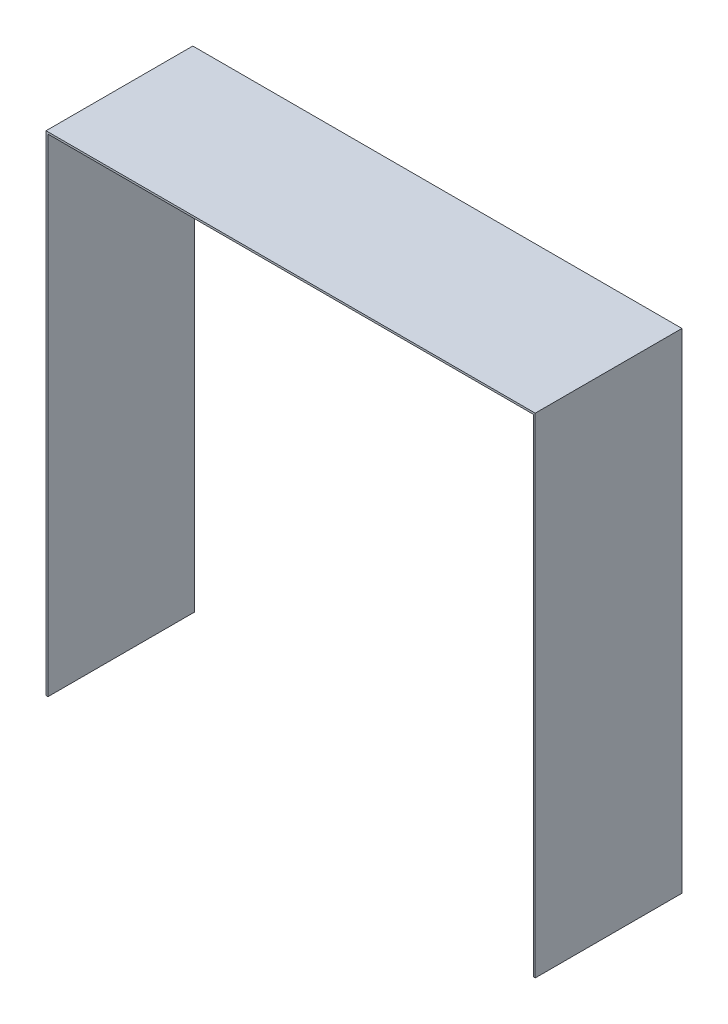
ISO-10303-21;
HEADER;
FILE_DESCRIPTION(('STEP AP214'),'2;1');
FILE_NAME('part.step','',(''),(''),'','','');
FILE_SCHEMA(('AUTOMOTIVE_DESIGN { 1 0 10303 214 1 1 1 1 }'));
ENDSEC;
DATA;
#1=APPLICATION_CONTEXT('core data for automotive mechanical design processes');
#2=APPLICATION_PROTOCOL_DEFINITION('international standard','automotive_design',2000,#1);
#3=PRODUCT_CONTEXT('',#1,'mechanical');
#4=PRODUCT('Part','Part','',(#3));
#5=PRODUCT_RELATED_PRODUCT_CATEGORY('part','',(#4));
#6=PRODUCT_DEFINITION_FORMATION('','',#4);
#7=PRODUCT_DEFINITION_CONTEXT('part definition',#1,'design');
#8=PRODUCT_DEFINITION('design','',#6,#7);
#9=PRODUCT_DEFINITION_SHAPE('','',#8);
#10=(LENGTH_UNIT() NAMED_UNIT(*) SI_UNIT(.MILLI.,.METRE.));
#11=(NAMED_UNIT(*) PLANE_ANGLE_UNIT() SI_UNIT($,.RADIAN.));
#12=(NAMED_UNIT(*) SI_UNIT($,.STERADIAN.) SOLID_ANGLE_UNIT());
#13=UNCERTAINTY_MEASURE_WITH_UNIT(LENGTH_MEASURE(1.E-05),#10,'distance_accuracy_value','');
#14=(GEOMETRIC_REPRESENTATION_CONTEXT(3) GLOBAL_UNCERTAINTY_ASSIGNED_CONTEXT((#13)) GLOBAL_UNIT_ASSIGNED_CONTEXT((#10,
#11,#12)) REPRESENTATION_CONTEXT('',''));
#15=CARTESIAN_POINT('',(0.,0.,0.));
#16=DIRECTION('',(0.,0.,1.));
#17=DIRECTION('',(1.,0.,0.));
#18=AXIS2_PLACEMENT_3D('',#15,#16,#17);
#19=CARTESIAN_POINT('',(0.,500.,150.));
#20=DIRECTION('',(1.,0.,0.));
#21=DIRECTION('',(0.,1.,0.));
#22=AXIS2_PLACEMENT_3D('',#19,#20,#21);
#23=PLANE('',#22);
#24=DIRECTION('',(0.,-1.,0.));
#25=VECTOR('',#24,1.);
#26=CARTESIAN_POINT('',(0.,500.,0.));
#27=LINE('',#26,#25);
#28=CARTESIAN_POINT('',(0.,500.,0.));
#29=VERTEX_POINT('',#28);
#30=CARTESIAN_POINT('',(0.,0.,0.));
#31=VERTEX_POINT('',#30);
#32=EDGE_CURVE('E133',#29,#31,#27,.T.);
#33=ORIENTED_EDGE('',*,*,#32,.T.);
#34=DIRECTION('',(0.,0.,-1.));
#35=VECTOR('',#34,1.);
#36=CARTESIAN_POINT('',(0.,0.,150.));
#37=LINE('',#36,#35);
#38=CARTESIAN_POINT('',(0.,0.,150.));
#39=VERTEX_POINT('',#38);
#40=EDGE_CURVE('E11',#39,#31,#37,.T.);
#41=ORIENTED_EDGE('',*,*,#40,.F.);
#42=DIRECTION('',(0.,-1.,0.));
#43=VECTOR('',#42,1.);
#44=CARTESIAN_POINT('',(0.,500.,150.));
#45=LINE('',#44,#43);
#46=CARTESIAN_POINT('',(0.,500.,150.));
#47=VERTEX_POINT('',#46);
#48=EDGE_CURVE('E147',#47,#39,#45,.T.);
#49=ORIENTED_EDGE('',*,*,#48,.F.);
#50=DIRECTION('',(0.,0.,-1.));
#51=VECTOR('',#50,1.);
#52=CARTESIAN_POINT('',(0.,500.,150.));
#53=LINE('',#52,#51);
#54=EDGE_CURVE('E129',#47,#29,#53,.T.);
#55=ORIENTED_EDGE('',*,*,#54,.T.);
#56=EDGE_LOOP('',(#33,#41,#49,#55));
#57=FACE_BOUND('',#56,.T.);
#58=ADVANCED_FACE('F37',(#57),#23,.F.);
#59=CARTESIAN_POINT('',(0.,0.,150.));
#60=DIRECTION('',(0.,1.,0.));
#61=DIRECTION('',(0.,0.,1.));
#62=AXIS2_PLACEMENT_3D('',#59,#60,#61);
#63=PLANE('',#62);
#64=DIRECTION('',(1.,0.,0.));
#65=VECTOR('',#64,1.);
#66=CARTESIAN_POINT('',(0.,0.,0.));
#67=LINE('',#66,#65);
#68=CARTESIAN_POINT('',(2.,0.,0.));
#69=VERTEX_POINT('',#68);
#70=EDGE_CURVE('E136',#31,#69,#67,.T.);
#71=ORIENTED_EDGE('',*,*,#70,.T.);
#72=DIRECTION('',(0.,0.,-1.));
#73=VECTOR('',#72,1.);
#74=CARTESIAN_POINT('',(2.,0.,150.));
#75=LINE('',#74,#73);
#76=CARTESIAN_POINT('',(2.,0.,150.));
#77=VERTEX_POINT('',#76);
#78=EDGE_CURVE('E45',#77,#69,#75,.T.);
#79=ORIENTED_EDGE('',*,*,#78,.F.);
#80=DIRECTION('',(1.,0.,0.));
#81=VECTOR('',#80,1.);
#82=CARTESIAN_POINT('',(0.,0.,150.));
#83=LINE('',#82,#81);
#84=EDGE_CURVE('E96',#39,#77,#83,.T.);
#85=ORIENTED_EDGE('',*,*,#84,.F.);
#86=ORIENTED_EDGE('',*,*,#40,.T.);
#87=EDGE_LOOP('',(#71,#79,#85,#86));
#88=FACE_BOUND('',#87,.T.);
#89=ADVANCED_FACE('F182',(#88),#63,.F.);
#90=CARTESIAN_POINT('',(2.,0.,150.));
#91=DIRECTION('',(-1.,0.,0.));
#92=DIRECTION('',(0.,0.,1.));
#93=AXIS2_PLACEMENT_3D('',#90,#91,#92);
#94=PLANE('',#93);
#95=DIRECTION('',(0.,1.,0.));
#96=VECTOR('',#95,1.);
#97=CARTESIAN_POINT('',(2.,0.,0.));
#98=LINE('',#97,#96);
#99=CARTESIAN_POINT('',(2.,498.,0.));
#100=VERTEX_POINT('',#99);
#101=EDGE_CURVE('E138',#69,#100,#98,.T.);
#102=ORIENTED_EDGE('',*,*,#101,.T.);
#103=DIRECTION('',(0.,0.,-1.));
#104=VECTOR('',#103,1.);
#105=CARTESIAN_POINT('',(2.,498.,150.));
#106=LINE('',#105,#104);
#107=CARTESIAN_POINT('',(2.,498.,150.));
#108=VERTEX_POINT('',#107);
#109=EDGE_CURVE('E154',#108,#100,#106,.T.);
#110=ORIENTED_EDGE('',*,*,#109,.F.);
#111=DIRECTION('',(0.,1.,0.));
#112=VECTOR('',#111,1.);
#113=CARTESIAN_POINT('',(2.,0.,150.));
#114=LINE('',#113,#112);
#115=EDGE_CURVE('E162',#77,#108,#114,.T.);
#116=ORIENTED_EDGE('',*,*,#115,.F.);
#117=ORIENTED_EDGE('',*,*,#78,.T.);
#118=EDGE_LOOP('',(#102,#110,#116,#117));
#119=FACE_BOUND('',#118,.T.);
#120=ADVANCED_FACE('F160',(#119),#94,.F.);
#121=CARTESIAN_POINT('',(2.,498.,150.));
#122=DIRECTION('',(0.,1.,0.));
#123=DIRECTION('',(0.,0.,1.));
#124=AXIS2_PLACEMENT_3D('',#121,#122,#123);
#125=PLANE('',#124);
#126=DIRECTION('',(1.,0.,0.));
#127=VECTOR('',#126,1.);
#128=CARTESIAN_POINT('',(2.,498.,0.));
#129=LINE('',#128,#127);
#130=CARTESIAN_POINT('',(498.,498.,0.));
#131=VERTEX_POINT('',#130);
#132=EDGE_CURVE('E140',#100,#131,#129,.T.);
#133=ORIENTED_EDGE('',*,*,#132,.T.);
#134=DIRECTION('',(0.,0.,-1.));
#135=VECTOR('',#134,1.);
#136=CARTESIAN_POINT('',(498.,498.,150.));
#137=LINE('',#136,#135);
#138=CARTESIAN_POINT('',(498.,498.,150.));
#139=VERTEX_POINT('',#138);
#140=EDGE_CURVE('E151',#139,#131,#137,.T.);
#141=ORIENTED_EDGE('',*,*,#140,.F.);
#142=DIRECTION('',(1.,0.,0.));
#143=VECTOR('',#142,1.);
#144=CARTESIAN_POINT('',(2.,498.,150.));
#145=LINE('',#144,#143);
#146=EDGE_CURVE('E174',#108,#139,#145,.T.);
#147=ORIENTED_EDGE('',*,*,#146,.F.);
#148=ORIENTED_EDGE('',*,*,#109,.T.);
#149=EDGE_LOOP('',(#133,#141,#147,#148));
#150=FACE_BOUND('',#149,.T.);
#151=ADVANCED_FACE('F170',(#150),#125,.F.);
#152=CARTESIAN_POINT('',(498.,498.,150.));
#153=DIRECTION('',(1.,0.,0.));
#154=DIRECTION('',(0.,1.,0.));
#155=AXIS2_PLACEMENT_3D('',#152,#153,#154);
#156=PLANE('',#155);
#157=DIRECTION('',(0.,-1.,0.));
#158=VECTOR('',#157,1.);
#159=CARTESIAN_POINT('',(498.,498.,0.));
#160=LINE('',#159,#158);
#161=CARTESIAN_POINT('',(498.,0.,0.));
#162=VERTEX_POINT('',#161);
#163=EDGE_CURVE('E142',#131,#162,#160,.T.);
#164=ORIENTED_EDGE('',*,*,#163,.T.);
#165=DIRECTION('',(0.,0.,-1.));
#166=VECTOR('',#165,1.);
#167=CARTESIAN_POINT('',(498.,0.,150.));
#168=LINE('',#167,#166);
#169=CARTESIAN_POINT('',(498.,0.,150.));
#170=VERTEX_POINT('',#169);
#171=EDGE_CURVE('E124',#170,#162,#168,.T.);
#172=ORIENTED_EDGE('',*,*,#171,.F.);
#173=DIRECTION('',(0.,-1.,0.));
#174=VECTOR('',#173,1.);
#175=CARTESIAN_POINT('',(498.,498.,150.));
#176=LINE('',#175,#174);
#177=EDGE_CURVE('E115',#139,#170,#176,.T.);
#178=ORIENTED_EDGE('',*,*,#177,.F.);
#179=ORIENTED_EDGE('',*,*,#140,.T.);
#180=EDGE_LOOP('',(#164,#172,#178,#179));
#181=FACE_BOUND('',#180,.T.);
#182=ADVANCED_FACE('F173',(#181),#156,.F.);
#183=CARTESIAN_POINT('',(498.,0.,150.));
#184=DIRECTION('',(0.,1.,0.));
#185=DIRECTION('',(-1.,0.,0.));
#186=AXIS2_PLACEMENT_3D('',#183,#184,#185);
#187=PLANE('',#186);
#188=DIRECTION('',(1.,0.,0.));
#189=VECTOR('',#188,1.);
#190=CARTESIAN_POINT('',(498.,0.,0.));
#191=LINE('',#190,#189);
#192=CARTESIAN_POINT('',(500.,0.,0.));
#193=VERTEX_POINT('',#192);
#194=EDGE_CURVE('E123',#162,#193,#191,.T.);
#195=ORIENTED_EDGE('',*,*,#194,.T.);
#196=DIRECTION('',(0.,0.,-1.));
#197=VECTOR('',#196,1.);
#198=CARTESIAN_POINT('',(500.,0.,150.));
#199=LINE('',#198,#197);
#200=CARTESIAN_POINT('',(500.,0.,150.));
#201=VERTEX_POINT('',#200);
#202=EDGE_CURVE('E120',#201,#193,#199,.T.);
#203=ORIENTED_EDGE('',*,*,#202,.F.);
#204=DIRECTION('',(1.,0.,0.));
#205=VECTOR('',#204,1.);
#206=CARTESIAN_POINT('',(498.,0.,150.));
#207=LINE('',#206,#205);
#208=EDGE_CURVE('E109',#170,#201,#207,.T.);
#209=ORIENTED_EDGE('',*,*,#208,.F.);
#210=ORIENTED_EDGE('',*,*,#171,.T.);
#211=EDGE_LOOP('',(#195,#203,#209,#210));
#212=FACE_BOUND('',#211,.T.);
#213=ADVANCED_FACE('F121',(#212),#187,.F.);
#214=CARTESIAN_POINT('',(500.,0.,150.));
#215=DIRECTION('',(-1.,0.,0.));
#216=DIRECTION('',(0.,-1.,0.));
#217=AXIS2_PLACEMENT_3D('',#214,#215,#216);
#218=PLANE('',#217);
#219=DIRECTION('',(0.,1.,0.));
#220=VECTOR('',#219,1.);
#221=CARTESIAN_POINT('',(500.,0.,0.));
#222=LINE('',#221,#220);
#223=CARTESIAN_POINT('',(500.,500.,0.));
#224=VERTEX_POINT('',#223);
#225=EDGE_CURVE('E82',#193,#224,#222,.T.);
#226=ORIENTED_EDGE('',*,*,#225,.T.);
#227=DIRECTION('',(0.,0.,-1.));
#228=VECTOR('',#227,1.);
#229=CARTESIAN_POINT('',(500.,500.,150.));
#230=LINE('',#229,#228);
#231=CARTESIAN_POINT('',(500.,500.,150.));
#232=VERTEX_POINT('',#231);
#233=EDGE_CURVE('E125',#232,#224,#230,.T.);
#234=ORIENTED_EDGE('',*,*,#233,.F.);
#235=DIRECTION('',(0.,1.,0.));
#236=VECTOR('',#235,1.);
#237=CARTESIAN_POINT('',(500.,0.,150.));
#238=LINE('',#237,#236);
#239=EDGE_CURVE('E113',#201,#232,#238,.T.);
#240=ORIENTED_EDGE('',*,*,#239,.F.);
#241=ORIENTED_EDGE('',*,*,#202,.T.);
#242=EDGE_LOOP('',(#226,#234,#240,#241));
#243=FACE_BOUND('',#242,.T.);
#244=ADVANCED_FACE('F127',(#243),#218,.F.);
#245=CARTESIAN_POINT('',(500.,500.,150.));
#246=DIRECTION('',(0.,-1.,0.));
#247=DIRECTION('',(0.,0.,-1.));
#248=AXIS2_PLACEMENT_3D('',#245,#246,#247);
#249=PLANE('',#248);
#250=DIRECTION('',(-1.,0.,0.));
#251=VECTOR('',#250,1.);
#252=CARTESIAN_POINT('',(500.,500.,0.));
#253=LINE('',#252,#251);
#254=EDGE_CURVE('E88',#224,#29,#253,.T.);
#255=ORIENTED_EDGE('',*,*,#254,.T.);
#256=ORIENTED_EDGE('',*,*,#54,.F.);
#257=DIRECTION('',(-1.,0.,0.));
#258=VECTOR('',#257,1.);
#259=CARTESIAN_POINT('',(500.,500.,150.));
#260=LINE('',#259,#258);
#261=EDGE_CURVE('E53',#232,#47,#260,.T.);
#262=ORIENTED_EDGE('',*,*,#261,.F.);
#263=ORIENTED_EDGE('',*,*,#233,.T.);
#264=EDGE_LOOP('',(#255,#256,#262,#263));
#265=FACE_BOUND('',#264,.T.);
#266=ADVANCED_FACE('F198',(#265),#249,.F.);
#267=CARTESIAN_POINT('',(0.,0.,150.));
#268=DIRECTION('',(0.,0.,1.));
#269=DIRECTION('',(1.,0.,0.));
#270=AXIS2_PLACEMENT_3D('',#267,#268,#269);
#271=PLANE('',#270);
#272=ORIENTED_EDGE('',*,*,#48,.T.);
#273=ORIENTED_EDGE('',*,*,#84,.T.);
#274=ORIENTED_EDGE('',*,*,#115,.T.);
#275=ORIENTED_EDGE('',*,*,#146,.T.);
#276=ORIENTED_EDGE('',*,*,#177,.T.);
#277=ORIENTED_EDGE('',*,*,#208,.T.);
#278=ORIENTED_EDGE('',*,*,#239,.T.);
#279=ORIENTED_EDGE('',*,*,#261,.T.);
#280=EDGE_LOOP('',(#272,#273,#274,#275,#276,#277,#278,#279));
#281=FACE_BOUND('',#280,.T.);
#282=ADVANCED_FACE('F111',(#281),#271,.T.);
#283=CARTESIAN_POINT('',(0.,0.,0.));
#284=DIRECTION('',(0.,0.,1.));
#285=DIRECTION('',(1.,0.,0.));
#286=AXIS2_PLACEMENT_3D('',#283,#284,#285);
#287=PLANE('',#286);
#288=ORIENTED_EDGE('',*,*,#32,.F.);
#289=ORIENTED_EDGE('',*,*,#254,.F.);
#290=ORIENTED_EDGE('',*,*,#225,.F.);
#291=ORIENTED_EDGE('',*,*,#194,.F.);
#292=ORIENTED_EDGE('',*,*,#163,.F.);
#293=ORIENTED_EDGE('',*,*,#132,.F.);
#294=ORIENTED_EDGE('',*,*,#101,.F.);
#295=ORIENTED_EDGE('',*,*,#70,.F.);
#296=EDGE_LOOP('',(#288,#289,#290,#291,#292,#293,#294,#295));
#297=FACE_BOUND('',#296,.T.);
#298=ADVANCED_FACE('F166',(#297),#287,.F.);
#299=CLOSED_SHELL('',(#58,#89,#120,#151,#182,#213,#244,#266,#282,#298));
#300=MANIFOLD_SOLID_BREP('B2',#299);
#301=ADVANCED_BREP_SHAPE_REPRESENTATION('',(#18,#300),#14);
#302=SHAPE_DEFINITION_REPRESENTATION(#9,#301);
ENDSEC;
END-ISO-10303-21;
